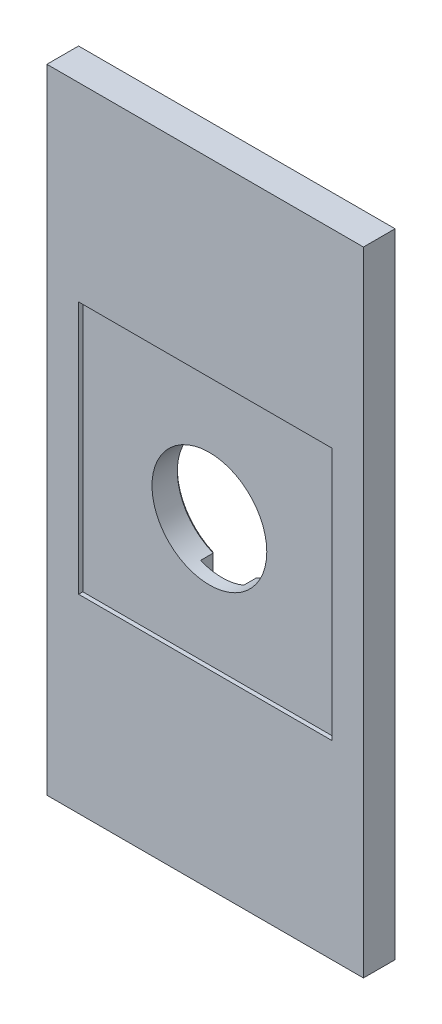
ISO-10303-21;
HEADER;
FILE_DESCRIPTION(('STEP AP214'),'2;1');
FILE_NAME('part.step','',(''),(''),'','','');
FILE_SCHEMA(('AUTOMOTIVE_DESIGN { 1 0 10303 214 1 1 1 1 }'));
ENDSEC;
DATA;
#1=APPLICATION_CONTEXT('core data for automotive mechanical design processes');
#2=APPLICATION_PROTOCOL_DEFINITION('international standard','automotive_design',2000,#1);
#3=PRODUCT_CONTEXT('',#1,'mechanical');
#4=PRODUCT('Part','Part','',(#3));
#5=PRODUCT_RELATED_PRODUCT_CATEGORY('part','',(#4));
#6=PRODUCT_DEFINITION_FORMATION('','',#4);
#7=PRODUCT_DEFINITION_CONTEXT('part definition',#1,'design');
#8=PRODUCT_DEFINITION('design','',#6,#7);
#9=PRODUCT_DEFINITION_SHAPE('','',#8);
#10=(LENGTH_UNIT() NAMED_UNIT(*) SI_UNIT(.MILLI.,.METRE.));
#11=(NAMED_UNIT(*) PLANE_ANGLE_UNIT() SI_UNIT($,.RADIAN.));
#12=(NAMED_UNIT(*) SI_UNIT($,.STERADIAN.) SOLID_ANGLE_UNIT());
#13=UNCERTAINTY_MEASURE_WITH_UNIT(LENGTH_MEASURE(1.E-05),#10,'distance_accuracy_value','');
#14=(GEOMETRIC_REPRESENTATION_CONTEXT(3) GLOBAL_UNCERTAINTY_ASSIGNED_CONTEXT((#13)) GLOBAL_UNIT_ASSIGNED_CONTEXT((#10,
#11,#12)) REPRESENTATION_CONTEXT('',''));
#15=CARTESIAN_POINT('',(0.,0.,0.));
#16=DIRECTION('',(0.,0.,1.));
#17=DIRECTION('',(1.,0.,0.));
#18=AXIS2_PLACEMENT_3D('',#15,#16,#17);
#19=CARTESIAN_POINT('',(0.,0.,-7.5));
#20=DIRECTION('',(0.,0.,1.));
#21=DIRECTION('',(1.,0.,0.));
#22=AXIS2_PLACEMENT_3D('',#19,#20,#21);
#23=PLANE('',#22);
#24=DIRECTION('',(0.,1.,0.));
#25=VECTOR('',#24,1.);
#26=CARTESIAN_POINT('',(5.6,0.,-7.5));
#27=LINE('',#26,#25);
#28=CARTESIAN_POINT('',(5.6,-30.6,-7.5));
#29=VERTEX_POINT('',#28);
#30=CARTESIAN_POINT('',(5.6,-12.9402472928457,-7.5));
#31=VERTEX_POINT('',#30);
#32=EDGE_CURVE('E303',#29,#31,#27,.T.);
#33=ORIENTED_EDGE('',*,*,#32,.T.);
#34=CARTESIAN_POINT('',(0.,0.,-7.5));
#35=DIRECTION('',(0.,0.,1.));
#36=DIRECTION('',(1.,0.,0.));
#37=AXIS2_PLACEMENT_3D('',#34,#35,#36);
#38=CIRCLE('',#37,14.1);
#39=CARTESIAN_POINT('',(5.6,12.9402472928457,-7.5));
#40=VERTEX_POINT('',#39);
#41=EDGE_CURVE('E305',#31,#40,#38,.T.);
#42=ORIENTED_EDGE('',*,*,#41,.T.);
#43=DIRECTION('',(0.,1.,0.));
#44=VECTOR('',#43,1.);
#45=CARTESIAN_POINT('',(5.6,0.,-7.5));
#46=LINE('',#45,#44);
#47=CARTESIAN_POINT('',(5.6,30.6,-7.5));
#48=VERTEX_POINT('',#47);
#49=EDGE_CURVE('E291',#40,#48,#46,.T.);
#50=ORIENTED_EDGE('',*,*,#49,.T.);
#51=DIRECTION('',(-1.,0.,0.));
#52=VECTOR('',#51,1.);
#53=CARTESIAN_POINT('',(0.,30.6,-7.5));
#54=LINE('',#53,#52);
#55=CARTESIAN_POINT('',(-5.60000000000001,30.6,-7.5));
#56=VERTEX_POINT('',#55);
#57=EDGE_CURVE('E293',#48,#56,#54,.T.);
#58=ORIENTED_EDGE('',*,*,#57,.T.);
#59=DIRECTION('',(0.,-1.,0.));
#60=VECTOR('',#59,1.);
#61=CARTESIAN_POINT('',(-5.60000000000001,0.,-7.5));
#62=LINE('',#61,#60);
#63=CARTESIAN_POINT('',(-5.60000000000001,12.9402472928457,-7.5));
#64=VERTEX_POINT('',#63);
#65=EDGE_CURVE('E295',#56,#64,#62,.T.);
#66=ORIENTED_EDGE('',*,*,#65,.T.);
#67=CARTESIAN_POINT('',(0.,0.,-7.5));
#68=DIRECTION('',(0.,0.,1.));
#69=DIRECTION('',(1.,0.,0.));
#70=AXIS2_PLACEMENT_3D('',#67,#68,#69);
#71=CIRCLE('',#70,14.1);
#72=CARTESIAN_POINT('',(-5.6,-12.9402472928457,-7.5));
#73=VERTEX_POINT('',#72);
#74=EDGE_CURVE('E297',#64,#73,#71,.T.);
#75=ORIENTED_EDGE('',*,*,#74,.T.);
#76=DIRECTION('',(0.,-1.,0.));
#77=VECTOR('',#76,1.);
#78=CARTESIAN_POINT('',(-5.6,0.,-7.5));
#79=LINE('',#78,#77);
#80=CARTESIAN_POINT('',(-5.6,-30.6,-7.5));
#81=VERTEX_POINT('',#80);
#82=EDGE_CURVE('E299',#73,#81,#79,.T.);
#83=ORIENTED_EDGE('',*,*,#82,.T.);
#84=DIRECTION('',(1.,0.,0.));
#85=VECTOR('',#84,1.);
#86=CARTESIAN_POINT('',(0.,-30.6,-7.5));
#87=LINE('',#86,#85);
#88=EDGE_CURVE('E301',#81,#29,#87,.T.);
#89=ORIENTED_EDGE('',*,*,#88,.T.);
#90=EDGE_LOOP('',(#33,#42,#50,#58,#66,#75,#83,#89));
#91=FACE_BOUND('',#90,.T.);
#92=DIRECTION('',(-1.,0.,0.));
#93=VECTOR('',#92,1.);
#94=CARTESIAN_POINT('',(-37.5,-75.,-7.50000000000001));
#95=LINE('',#94,#93);
#96=CARTESIAN_POINT('',(37.5,-75.,-7.50000000000001));
#97=VERTEX_POINT('',#96);
#98=CARTESIAN_POINT('',(-37.5,-75.,-7.50000000000001));
#99=VERTEX_POINT('',#98);
#100=EDGE_CURVE('E262',#97,#99,#95,.T.);
#101=ORIENTED_EDGE('',*,*,#100,.T.);
#102=DIRECTION('',(0.,1.,0.));
#103=VECTOR('',#102,1.);
#104=CARTESIAN_POINT('',(-37.5,-75.,-7.50000000000001));
#105=LINE('',#104,#103);
#106=CARTESIAN_POINT('',(-37.5,75.,-7.50000000000001));
#107=VERTEX_POINT('',#106);
#108=EDGE_CURVE('E265',#99,#107,#105,.T.);
#109=ORIENTED_EDGE('',*,*,#108,.T.);
#110=DIRECTION('',(1.,0.,0.));
#111=VECTOR('',#110,1.);
#112=CARTESIAN_POINT('',(-37.5,75.,-7.50000000000001));
#113=LINE('',#112,#111);
#114=CARTESIAN_POINT('',(37.5,75.,-7.50000000000006));
#115=VERTEX_POINT('',#114);
#116=EDGE_CURVE('E263',#107,#115,#113,.T.);
#117=ORIENTED_EDGE('',*,*,#116,.T.);
#118=DIRECTION('',(0.,-1.,0.));
#119=VECTOR('',#118,1.);
#120=CARTESIAN_POINT('',(37.5,-75.,-7.50000000000001));
#121=LINE('',#120,#119);
#122=EDGE_CURVE('E200',#115,#97,#121,.T.);
#123=ORIENTED_EDGE('',*,*,#122,.T.);
#124=EDGE_LOOP('',(#101,#109,#117,#123));
#125=FACE_BOUND('',#124,.T.);
#126=ADVANCED_FACE('F43',(#91,#125),#23,.F.);
#127=CARTESIAN_POINT('',(-30.,30.,-85.8528137423857));
#128=DIRECTION('',(0.,1.,0.));
#129=DIRECTION('',(0.,0.,1.));
#130=AXIS2_PLACEMENT_3D('',#127,#128,#129);
#131=PLANE('',#130);
#132=DIRECTION('',(1.,0.,0.));
#133=VECTOR('',#132,1.);
#134=CARTESIAN_POINT('',(-30.,30.,-1.));
#135=LINE('',#134,#133);
#136=CARTESIAN_POINT('',(-30.,30.,-1.));
#137=VERTEX_POINT('',#136);
#138=CARTESIAN_POINT('',(30.,30.,-1.));
#139=VERTEX_POINT('',#138);
#140=EDGE_CURVE('E233',#137,#139,#135,.T.);
#141=ORIENTED_EDGE('',*,*,#140,.T.);
#142=DIRECTION('',(0.,0.,1.));
#143=VECTOR('',#142,1.);
#144=CARTESIAN_POINT('',(30.,30.,-85.8528137423857));
#145=LINE('',#144,#143);
#146=CARTESIAN_POINT('',(30.,30.,0.));
#147=VERTEX_POINT('',#146);
#148=EDGE_CURVE('E253',#139,#147,#145,.T.);
#149=ORIENTED_EDGE('',*,*,#148,.T.);
#150=DIRECTION('',(-1.,0.,0.));
#151=VECTOR('',#150,1.);
#152=CARTESIAN_POINT('',(-30.,30.,0.));
#153=LINE('',#152,#151);
#154=CARTESIAN_POINT('',(-30.,30.,0.));
#155=VERTEX_POINT('',#154);
#156=EDGE_CURVE('E245',#147,#155,#153,.T.);
#157=ORIENTED_EDGE('',*,*,#156,.T.);
#158=DIRECTION('',(0.,0.,1.));
#159=VECTOR('',#158,1.);
#160=CARTESIAN_POINT('',(-30.,30.,-85.8528137423857));
#161=LINE('',#160,#159);
#162=EDGE_CURVE('E258',#137,#155,#161,.T.);
#163=ORIENTED_EDGE('',*,*,#162,.F.);
#164=EDGE_LOOP('',(#141,#149,#157,#163));
#165=FACE_BOUND('',#164,.T.);
#166=ADVANCED_FACE('F454',(#165),#131,.F.);
#167=CARTESIAN_POINT('',(-30.,-30.,-85.8528137423857));
#168=DIRECTION('',(-1.,0.,0.));
#169=DIRECTION('',(0.,0.,1.));
#170=AXIS2_PLACEMENT_3D('',#167,#168,#169);
#171=PLANE('',#170);
#172=DIRECTION('',(0.,1.,0.));
#173=VECTOR('',#172,1.);
#174=CARTESIAN_POINT('',(-30.,-30.,-1.));
#175=LINE('',#174,#173);
#176=CARTESIAN_POINT('',(-30.,-30.,-1.));
#177=VERTEX_POINT('',#176);
#178=EDGE_CURVE('E237',#177,#137,#175,.T.);
#179=ORIENTED_EDGE('',*,*,#178,.T.);
#180=ORIENTED_EDGE('',*,*,#162,.T.);
#181=DIRECTION('',(0.,-1.,0.));
#182=VECTOR('',#181,1.);
#183=CARTESIAN_POINT('',(-30.,-30.,0.));
#184=LINE('',#183,#182);
#185=CARTESIAN_POINT('',(-30.,-30.,0.));
#186=VERTEX_POINT('',#185);
#187=EDGE_CURVE('E248',#155,#186,#184,.T.);
#188=ORIENTED_EDGE('',*,*,#187,.T.);
#189=DIRECTION('',(0.,0.,1.));
#190=VECTOR('',#189,1.);
#191=CARTESIAN_POINT('',(-30.,-30.,-85.8528137423857));
#192=LINE('',#191,#190);
#193=EDGE_CURVE('E256',#177,#186,#192,.T.);
#194=ORIENTED_EDGE('',*,*,#193,.F.);
#195=EDGE_LOOP('',(#179,#180,#188,#194));
#196=FACE_BOUND('',#195,.T.);
#197=ADVANCED_FACE('F461',(#196),#171,.F.);
#198=CARTESIAN_POINT('',(-30.,-30.,-85.8528137423857));
#199=DIRECTION('',(0.,-1.,0.));
#200=DIRECTION('',(0.,0.,-1.));
#201=AXIS2_PLACEMENT_3D('',#198,#199,#200);
#202=PLANE('',#201);
#203=DIRECTION('',(-1.,0.,0.));
#204=VECTOR('',#203,1.);
#205=CARTESIAN_POINT('',(-30.,-30.,-1.));
#206=LINE('',#205,#204);
#207=CARTESIAN_POINT('',(30.,-30.,-1.));
#208=VERTEX_POINT('',#207);
#209=EDGE_CURVE('E239',#208,#177,#206,.T.);
#210=ORIENTED_EDGE('',*,*,#209,.T.);
#211=ORIENTED_EDGE('',*,*,#193,.T.);
#212=DIRECTION('',(1.,0.,0.));
#213=VECTOR('',#212,1.);
#214=CARTESIAN_POINT('',(-30.,-30.,0.));
#215=LINE('',#214,#213);
#216=CARTESIAN_POINT('',(30.,-30.,0.));
#217=VERTEX_POINT('',#216);
#218=EDGE_CURVE('E251',#186,#217,#215,.T.);
#219=ORIENTED_EDGE('',*,*,#218,.T.);
#220=DIRECTION('',(0.,0.,1.));
#221=VECTOR('',#220,1.);
#222=CARTESIAN_POINT('',(30.,-30.,-85.8528137423857));
#223=LINE('',#222,#221);
#224=EDGE_CURVE('E240',#208,#217,#223,.T.);
#225=ORIENTED_EDGE('',*,*,#224,.F.);
#226=EDGE_LOOP('',(#210,#211,#219,#225));
#227=FACE_BOUND('',#226,.T.);
#228=ADVANCED_FACE('F545',(#227),#202,.F.);
#229=CARTESIAN_POINT('',(30.,-30.,-85.8528137423857));
#230=DIRECTION('',(1.,0.,0.));
#231=DIRECTION('',(0.,0.,-1.));
#232=AXIS2_PLACEMENT_3D('',#229,#230,#231);
#233=PLANE('',#232);
#234=DIRECTION('',(0.,-1.,0.));
#235=VECTOR('',#234,1.);
#236=CARTESIAN_POINT('',(30.,-30.,-1.));
#237=LINE('',#236,#235);
#238=EDGE_CURVE('E236',#139,#208,#237,.T.);
#239=ORIENTED_EDGE('',*,*,#238,.T.);
#240=ORIENTED_EDGE('',*,*,#224,.T.);
#241=DIRECTION('',(0.,1.,0.));
#242=VECTOR('',#241,1.);
#243=CARTESIAN_POINT('',(30.,-30.,0.));
#244=LINE('',#243,#242);
#245=EDGE_CURVE('E229',#217,#147,#244,.T.);
#246=ORIENTED_EDGE('',*,*,#245,.T.);
#247=ORIENTED_EDGE('',*,*,#148,.F.);
#248=EDGE_LOOP('',(#239,#240,#246,#247));
#249=FACE_BOUND('',#248,.T.);
#250=ADVANCED_FACE('F507',(#249),#233,.F.);
#251=CARTESIAN_POINT('',(0.,0.,-1.));
#252=DIRECTION('',(0.,0.,1.));
#253=DIRECTION('',(1.,0.,0.));
#254=AXIS2_PLACEMENT_3D('',#251,#252,#253);
#255=PLANE('',#254);
#256=CARTESIAN_POINT('',(0.,0.,-1.));
#257=DIRECTION('',(0.,0.,1.));
#258=DIRECTION('',(1.,0.,0.));
#259=AXIS2_PLACEMENT_3D('',#256,#257,#258);
#260=CIRCLE('',#259,13.6);
#261=CARTESIAN_POINT('',(13.6,0.,-1.));
#262=VERTEX_POINT('',#261);
#263=EDGE_CURVE('E209',#262,#262,#260,.F.);
#264=ORIENTED_EDGE('',*,*,#263,.T.);
#265=EDGE_LOOP('',(#264));
#266=FACE_BOUND('',#265,.T.);
#267=ORIENTED_EDGE('',*,*,#238,.F.);
#268=ORIENTED_EDGE('',*,*,#140,.F.);
#269=ORIENTED_EDGE('',*,*,#178,.F.);
#270=ORIENTED_EDGE('',*,*,#209,.F.);
#271=EDGE_LOOP('',(#267,#268,#269,#270));
#272=FACE_BOUND('',#271,.T.);
#273=ADVANCED_FACE('F501',(#266,#272),#255,.T.);
#274=CARTESIAN_POINT('',(-37.5,-75.,-175.205098312484));
#275=DIRECTION('',(-1.,0.,0.));
#276=DIRECTION('',(0.,-1.,0.));
#277=AXIS2_PLACEMENT_3D('',#274,#275,#276);
#278=PLANE('',#277);
#279=ORIENTED_EDGE('',*,*,#108,.F.);
#280=DIRECTION('',(0.,0.,1.));
#281=VECTOR('',#280,1.);
#282=CARTESIAN_POINT('',(-37.5,-75.,-175.205098312484));
#283=LINE('',#282,#281);
#284=CARTESIAN_POINT('',(-37.5,-75.,0.));
#285=VERTEX_POINT('',#284);
#286=EDGE_CURVE('E266',#99,#285,#283,.T.);
#287=ORIENTED_EDGE('',*,*,#286,.T.);
#288=DIRECTION('',(0.,-1.,0.));
#289=VECTOR('',#288,1.);
#290=CARTESIAN_POINT('',(-37.5,-75.,0.));
#291=LINE('',#290,#289);
#292=CARTESIAN_POINT('',(-37.5,75.,0.));
#293=VERTEX_POINT('',#292);
#294=EDGE_CURVE('E277',#293,#285,#291,.T.);
#295=ORIENTED_EDGE('',*,*,#294,.F.);
#296=DIRECTION('',(0.,0.,1.));
#297=VECTOR('',#296,1.);
#298=CARTESIAN_POINT('',(-37.5,75.,-175.205098312484));
#299=LINE('',#298,#297);
#300=EDGE_CURVE('E282',#107,#293,#299,.T.);
#301=ORIENTED_EDGE('',*,*,#300,.F.);
#302=EDGE_LOOP('',(#279,#287,#295,#301));
#303=FACE_BOUND('',#302,.T.);
#304=ADVANCED_FACE('F499',(#303),#278,.T.);
#305=CARTESIAN_POINT('',(-37.5,75.,-175.205098312484));
#306=DIRECTION('',(0.,1.,0.));
#307=DIRECTION('',(-1.,0.,0.));
#308=AXIS2_PLACEMENT_3D('',#305,#306,#307);
#309=PLANE('',#308);
#310=ORIENTED_EDGE('',*,*,#116,.F.);
#311=ORIENTED_EDGE('',*,*,#300,.T.);
#312=DIRECTION('',(-1.,0.,0.));
#313=VECTOR('',#312,1.);
#314=CARTESIAN_POINT('',(-37.5,75.,0.));
#315=LINE('',#314,#313);
#316=CARTESIAN_POINT('',(37.5,75.,0.));
#317=VERTEX_POINT('',#316);
#318=EDGE_CURVE('E274',#317,#293,#315,.T.);
#319=ORIENTED_EDGE('',*,*,#318,.F.);
#320=DIRECTION('',(0.,0.,1.));
#321=VECTOR('',#320,1.);
#322=CARTESIAN_POINT('',(37.5,75.,-175.205098312484));
#323=LINE('',#322,#321);
#324=EDGE_CURVE('E284',#115,#317,#323,.T.);
#325=ORIENTED_EDGE('',*,*,#324,.F.);
#326=EDGE_LOOP('',(#310,#311,#319,#325));
#327=FACE_BOUND('',#326,.T.);
#328=ADVANCED_FACE('F495',(#327),#309,.T.);
#329=CARTESIAN_POINT('',(37.5,-75.,-175.205098312484));
#330=DIRECTION('',(1.,0.,0.));
#331=DIRECTION('',(0.,0.,-1.));
#332=AXIS2_PLACEMENT_3D('',#329,#330,#331);
#333=PLANE('',#332);
#334=ORIENTED_EDGE('',*,*,#122,.F.);
#335=ORIENTED_EDGE('',*,*,#324,.T.);
#336=DIRECTION('',(0.,1.,0.));
#337=VECTOR('',#336,1.);
#338=CARTESIAN_POINT('',(37.5,-75.,0.));
#339=LINE('',#338,#337);
#340=CARTESIAN_POINT('',(37.5,-75.,0.));
#341=VERTEX_POINT('',#340);
#342=EDGE_CURVE('E271',#341,#317,#339,.T.);
#343=ORIENTED_EDGE('',*,*,#342,.F.);
#344=DIRECTION('',(0.,0.,1.));
#345=VECTOR('',#344,1.);
#346=CARTESIAN_POINT('',(37.5,-75.,-175.205098312484));
#347=LINE('',#346,#345);
#348=EDGE_CURVE('E280',#97,#341,#347,.T.);
#349=ORIENTED_EDGE('',*,*,#348,.F.);
#350=EDGE_LOOP('',(#334,#335,#343,#349));
#351=FACE_BOUND('',#350,.T.);
#352=ADVANCED_FACE('F477',(#351),#333,.T.);
#353=CARTESIAN_POINT('',(-37.5,-75.,-175.205098312484));
#354=DIRECTION('',(0.,-1.,0.));
#355=DIRECTION('',(1.,0.,0.));
#356=AXIS2_PLACEMENT_3D('',#353,#354,#355);
#357=PLANE('',#356);
#358=ORIENTED_EDGE('',*,*,#100,.F.);
#359=ORIENTED_EDGE('',*,*,#348,.T.);
#360=DIRECTION('',(1.,0.,0.));
#361=VECTOR('',#360,1.);
#362=CARTESIAN_POINT('',(-37.5,-75.,0.));
#363=LINE('',#362,#361);
#364=EDGE_CURVE('E235',#285,#341,#363,.T.);
#365=ORIENTED_EDGE('',*,*,#364,.F.);
#366=ORIENTED_EDGE('',*,*,#286,.F.);
#367=EDGE_LOOP('',(#358,#359,#365,#366));
#368=FACE_BOUND('',#367,.T.);
#369=ADVANCED_FACE('F465',(#368),#357,.T.);
#370=CARTESIAN_POINT('',(0.,0.,0.));
#371=DIRECTION('',(0.,0.,1.));
#372=DIRECTION('',(1.,0.,0.));
#373=AXIS2_PLACEMENT_3D('',#370,#371,#372);
#374=PLANE('',#373);
#375=ORIENTED_EDGE('',*,*,#156,.F.);
#376=ORIENTED_EDGE('',*,*,#245,.F.);
#377=ORIENTED_EDGE('',*,*,#218,.F.);
#378=ORIENTED_EDGE('',*,*,#187,.F.);
#379=EDGE_LOOP('',(#375,#376,#377,#378));
#380=FACE_BOUND('',#379,.T.);
#381=ORIENTED_EDGE('',*,*,#364,.T.);
#382=ORIENTED_EDGE('',*,*,#342,.T.);
#383=ORIENTED_EDGE('',*,*,#318,.T.);
#384=ORIENTED_EDGE('',*,*,#294,.T.);
#385=EDGE_LOOP('',(#381,#382,#383,#384));
#386=FACE_BOUND('',#385,.T.);
#387=ADVANCED_FACE('F467',(#380,#386),#374,.T.);
#388=CARTESIAN_POINT('',(0.,0.,-4.));
#389=DIRECTION('',(0.,0.,1.));
#390=DIRECTION('',(-1.,0.,0.));
#391=AXIS2_PLACEMENT_3D('',#388,#389,#390);
#392=PLANE('',#391);
#393=DIRECTION('',(0.,-1.,0.));
#394=VECTOR('',#393,1.);
#395=CARTESIAN_POINT('',(5.1,-12.6075374280626,-4.));
#396=LINE('',#395,#394);
#397=CARTESIAN_POINT('',(5.1,30.1,-3.99999999999999));
#398=VERTEX_POINT('',#397);
#399=CARTESIAN_POINT('',(5.1,12.6075374280626,-4.));
#400=VERTEX_POINT('',#399);
#401=EDGE_CURVE('E207',#398,#400,#396,.T.);
#402=ORIENTED_EDGE('',*,*,#401,.T.);
#403=CARTESIAN_POINT('',(0.,0.,-4.));
#404=DIRECTION('',(0.,0.,1.));
#405=DIRECTION('',(0.,-1.,0.));
#406=AXIS2_PLACEMENT_3D('',#403,#404,#405);
#407=CIRCLE('',#406,13.6);
#408=CARTESIAN_POINT('',(-5.10000000000001,12.6075374280626,-4.));
#409=VERTEX_POINT('',#408);
#410=EDGE_CURVE('E193',#400,#409,#407,.T.);
#411=ORIENTED_EDGE('',*,*,#410,.T.);
#412=DIRECTION('',(0.,1.,0.));
#413=VECTOR('',#412,1.);
#414=CARTESIAN_POINT('',(-5.10000000000001,12.6075374280626,-4.));
#415=LINE('',#414,#413);
#416=CARTESIAN_POINT('',(-5.10000000000001,30.1,-4.));
#417=VERTEX_POINT('',#416);
#418=EDGE_CURVE('E205',#409,#417,#415,.T.);
#419=ORIENTED_EDGE('',*,*,#418,.T.);
#420=DIRECTION('',(1.,0.,0.));
#421=VECTOR('',#420,1.);
#422=CARTESIAN_POINT('',(-5.10000000000001,30.1,-4.));
#423=LINE('',#422,#421);
#424=EDGE_CURVE('E222',#417,#398,#423,.T.);
#425=ORIENTED_EDGE('',*,*,#424,.T.);
#426=EDGE_LOOP('',(#402,#411,#419,#425));
#427=FACE_BOUND('',#426,.T.);
#428=ADVANCED_FACE('F203',(#427),#392,.F.);
#429=CARTESIAN_POINT('',(-5.1,-30.1,-4.));
#430=VERTEX_POINT('',#429);
#431=CARTESIAN_POINT('',(-5.1,-12.6075374280626,-4.));
#432=VERTEX_POINT('',#431);
#433=EDGE_CURVE('E213',#430,#432,#415,.T.);
#434=ORIENTED_EDGE('',*,*,#433,.T.);
#435=CARTESIAN_POINT('',(0.,0.,-4.));
#436=DIRECTION('',(0.,0.,1.));
#437=DIRECTION('',(0.,-1.,0.));
#438=AXIS2_PLACEMENT_3D('',#435,#436,#437);
#439=CIRCLE('',#438,13.6);
#440=CARTESIAN_POINT('',(5.1,-12.6075374280626,-4.));
#441=VERTEX_POINT('',#440);
#442=EDGE_CURVE('E416',#432,#441,#439,.T.);
#443=ORIENTED_EDGE('',*,*,#442,.T.);
#444=CARTESIAN_POINT('',(5.1,-30.1,-4.));
#445=VERTEX_POINT('',#444);
#446=EDGE_CURVE('E415',#441,#445,#396,.T.);
#447=ORIENTED_EDGE('',*,*,#446,.T.);
#448=DIRECTION('',(-1.,0.,0.));
#449=VECTOR('',#448,1.);
#450=CARTESIAN_POINT('',(5.1,-30.1,-4.));
#451=LINE('',#450,#449);
#452=EDGE_CURVE('E218',#445,#430,#451,.T.);
#453=ORIENTED_EDGE('',*,*,#452,.T.);
#454=EDGE_LOOP('',(#434,#443,#447,#453));
#455=FACE_BOUND('',#454,.T.);
#456=ADVANCED_FACE('F424',(#455),#392,.F.);
#457=CARTESIAN_POINT('',(-5.10000000000001,12.6075374280626,57.0580052081625));
#458=DIRECTION('',(-1.,0.,0.));
#459=DIRECTION('',(0.,-1.,0.));
#460=AXIS2_PLACEMENT_3D('',#457,#458,#459);
#461=PLANE('',#460);
#462=DIRECTION('',(0.,0.,-1.));
#463=VECTOR('',#462,1.);
#464=CARTESIAN_POINT('',(-5.1,-30.1,57.0580052081625));
#465=LINE('',#464,#463);
#466=CARTESIAN_POINT('',(-5.1,-30.1,-7.));
#467=VERTEX_POINT('',#466);
#468=EDGE_CURVE('E214',#430,#467,#465,.T.);
#469=ORIENTED_EDGE('',*,*,#468,.T.);
#470=DIRECTION('',(0.,1.,0.));
#471=VECTOR('',#470,1.);
#472=CARTESIAN_POINT('',(-5.10000000000001,12.6075374280626,-7.));
#473=LINE('',#472,#471);
#474=CARTESIAN_POINT('',(-5.1,-12.6075374280626,-7.));
#475=VERTEX_POINT('',#474);
#476=EDGE_CURVE('E312',#467,#475,#473,.T.);
#477=ORIENTED_EDGE('',*,*,#476,.T.);
#478=DIRECTION('',(0.,0.,-1.));
#479=VECTOR('',#478,1.);
#480=CARTESIAN_POINT('',(-5.1,-12.6075374280626,37.4666088965482));
#481=LINE('',#480,#479);
#482=EDGE_CURVE('E418',#475,#432,#481,.F.);
#483=ORIENTED_EDGE('',*,*,#482,.T.);
#484=ORIENTED_EDGE('',*,*,#433,.F.);
#485=EDGE_LOOP('',(#469,#477,#483,#484));
#486=FACE_BOUND('',#485,.T.);
#487=ADVANCED_FACE('F431',(#486),#461,.F.);
#488=CARTESIAN_POINT('',(5.1,-12.6075374280626,57.0580052081625));
#489=DIRECTION('',(1.,0.,0.));
#490=DIRECTION('',(0.,1.,0.));
#491=AXIS2_PLACEMENT_3D('',#488,#489,#490);
#492=PLANE('',#491);
#493=DIRECTION('',(0.,0.,-1.));
#494=VECTOR('',#493,1.);
#495=CARTESIAN_POINT('',(5.1,-12.6075374280626,37.4666088965482));
#496=LINE('',#495,#494);
#497=CARTESIAN_POINT('',(5.1,-12.6075374280626,-7.));
#498=VERTEX_POINT('',#497);
#499=EDGE_CURVE('E411',#441,#498,#496,.T.);
#500=ORIENTED_EDGE('',*,*,#499,.T.);
#501=DIRECTION('',(0.,-1.,0.));
#502=VECTOR('',#501,1.);
#503=CARTESIAN_POINT('',(5.1,-12.6075374280626,-7.));
#504=LINE('',#503,#502);
#505=CARTESIAN_POINT('',(5.1,-30.1,-7.));
#506=VERTEX_POINT('',#505);
#507=EDGE_CURVE('E308',#498,#506,#504,.T.);
#508=ORIENTED_EDGE('',*,*,#507,.T.);
#509=DIRECTION('',(0.,0.,-1.));
#510=VECTOR('',#509,1.);
#511=CARTESIAN_POINT('',(5.1,-30.1,57.0580052081625));
#512=LINE('',#511,#510);
#513=EDGE_CURVE('E226',#445,#506,#512,.T.);
#514=ORIENTED_EDGE('',*,*,#513,.F.);
#515=ORIENTED_EDGE('',*,*,#446,.F.);
#516=EDGE_LOOP('',(#500,#508,#514,#515));
#517=FACE_BOUND('',#516,.T.);
#518=ADVANCED_FACE('F414',(#517),#492,.F.);
#519=CARTESIAN_POINT('',(5.1,-30.1,57.0580052081625));
#520=DIRECTION('',(0.,-1.,0.));
#521=DIRECTION('',(1.,0.,0.));
#522=AXIS2_PLACEMENT_3D('',#519,#520,#521);
#523=PLANE('',#522);
#524=ORIENTED_EDGE('',*,*,#513,.T.);
#525=DIRECTION('',(-1.,0.,0.));
#526=VECTOR('',#525,1.);
#527=CARTESIAN_POINT('',(5.1,-30.1,-7.));
#528=LINE('',#527,#526);
#529=EDGE_CURVE('E310',#506,#467,#528,.T.);
#530=ORIENTED_EDGE('',*,*,#529,.T.);
#531=ORIENTED_EDGE('',*,*,#468,.F.);
#532=ORIENTED_EDGE('',*,*,#452,.F.);
#533=EDGE_LOOP('',(#524,#530,#531,#532));
#534=FACE_BOUND('',#533,.T.);
#535=ADVANCED_FACE('F427',(#534),#523,.F.);
#536=DIRECTION('',(0.,0.,-1.));
#537=VECTOR('',#536,1.);
#538=CARTESIAN_POINT('',(5.1,30.1,57.0580052081625));
#539=LINE('',#538,#537);
#540=CARTESIAN_POINT('',(5.1,30.1,-7.));
#541=VERTEX_POINT('',#540);
#542=EDGE_CURVE('E227',#398,#541,#539,.T.);
#543=ORIENTED_EDGE('',*,*,#542,.T.);
#544=DIRECTION('',(0.,-1.,0.));
#545=VECTOR('',#544,1.);
#546=CARTESIAN_POINT('',(5.1,-12.6075374280626,-7.));
#547=LINE('',#546,#545);
#548=CARTESIAN_POINT('',(5.1,12.6075374280626,-7.));
#549=VERTEX_POINT('',#548);
#550=EDGE_CURVE('E11',#541,#549,#547,.T.);
#551=ORIENTED_EDGE('',*,*,#550,.T.);
#552=DIRECTION('',(0.,0.,-1.));
#553=VECTOR('',#552,1.);
#554=CARTESIAN_POINT('',(5.1,12.6075374280626,37.4666088965482));
#555=LINE('',#554,#553);
#556=EDGE_CURVE('E208',#549,#400,#555,.F.);
#557=ORIENTED_EDGE('',*,*,#556,.T.);
#558=ORIENTED_EDGE('',*,*,#401,.F.);
#559=EDGE_LOOP('',(#543,#551,#557,#558));
#560=FACE_BOUND('',#559,.T.);
#561=ADVANCED_FACE('F442',(#560),#492,.F.);
#562=DIRECTION('',(0.,0.,-1.));
#563=VECTOR('',#562,1.);
#564=CARTESIAN_POINT('',(-5.10000000000001,12.6075374280626,37.4666088965482));
#565=LINE('',#564,#563);
#566=CARTESIAN_POINT('',(-5.10000000000001,12.6075374280626,-7.));
#567=VERTEX_POINT('',#566);
#568=EDGE_CURVE('E189',#409,#567,#565,.T.);
#569=ORIENTED_EDGE('',*,*,#568,.T.);
#570=DIRECTION('',(0.,1.,0.));
#571=VECTOR('',#570,1.);
#572=CARTESIAN_POINT('',(-5.10000000000001,12.6075374280626,-7.));
#573=LINE('',#572,#571);
#574=CARTESIAN_POINT('',(-5.10000000000001,30.1,-7.));
#575=VERTEX_POINT('',#574);
#576=EDGE_CURVE('E74',#567,#575,#573,.T.);
#577=ORIENTED_EDGE('',*,*,#576,.T.);
#578=DIRECTION('',(0.,0.,-1.));
#579=VECTOR('',#578,1.);
#580=CARTESIAN_POINT('',(-5.10000000000001,30.1,57.0580052081625));
#581=LINE('',#580,#579);
#582=EDGE_CURVE('E212',#417,#575,#581,.T.);
#583=ORIENTED_EDGE('',*,*,#582,.F.);
#584=ORIENTED_EDGE('',*,*,#418,.F.);
#585=EDGE_LOOP('',(#569,#577,#583,#584));
#586=FACE_BOUND('',#585,.T.);
#587=ADVANCED_FACE('F211',(#586),#461,.F.);
#588=CARTESIAN_POINT('',(-5.10000000000001,30.1,57.0580052081625));
#589=DIRECTION('',(0.,1.,0.));
#590=DIRECTION('',(-1.,0.,0.));
#591=AXIS2_PLACEMENT_3D('',#588,#589,#590);
#592=PLANE('',#591);
#593=ORIENTED_EDGE('',*,*,#582,.T.);
#594=DIRECTION('',(1.,0.,0.));
#595=VECTOR('',#594,1.);
#596=CARTESIAN_POINT('',(-5.10000000000001,30.1,-7.));
#597=LINE('',#596,#595);
#598=EDGE_CURVE('E59',#575,#541,#597,.T.);
#599=ORIENTED_EDGE('',*,*,#598,.T.);
#600=ORIENTED_EDGE('',*,*,#542,.F.);
#601=ORIENTED_EDGE('',*,*,#424,.F.);
#602=EDGE_LOOP('',(#593,#599,#600,#601));
#603=FACE_BOUND('',#602,.T.);
#604=ADVANCED_FACE('F443',(#603),#592,.F.);
#605=CARTESIAN_POINT('',(0.,0.,37.4666088965482));
#606=DIRECTION('',(0.,0.,-1.));
#607=DIRECTION('',(-1.,0.,0.));
#608=AXIS2_PLACEMENT_3D('',#605,#606,#607);
#609=CYLINDRICAL_SURFACE('',#608,13.6);
#610=ORIENTED_EDGE('',*,*,#263,.F.);
#611=EDGE_LOOP('',(#610));
#612=FACE_BOUND('',#611,.T.);
#613=ORIENTED_EDGE('',*,*,#556,.F.);
#614=CARTESIAN_POINT('',(0.,0.,-7.));
#615=DIRECTION('',(0.,0.,1.));
#616=DIRECTION('',(1.,0.,0.));
#617=AXIS2_PLACEMENT_3D('',#614,#615,#616);
#618=CIRCLE('',#617,13.6);
#619=EDGE_CURVE('E288',#549,#498,#618,.F.);
#620=ORIENTED_EDGE('',*,*,#619,.T.);
#621=ORIENTED_EDGE('',*,*,#499,.F.);
#622=ORIENTED_EDGE('',*,*,#442,.F.);
#623=ORIENTED_EDGE('',*,*,#482,.F.);
#624=CARTESIAN_POINT('',(0.,0.,-7.));
#625=DIRECTION('',(0.,0.,1.));
#626=DIRECTION('',(1.,0.,0.));
#627=AXIS2_PLACEMENT_3D('',#624,#625,#626);
#628=CIRCLE('',#627,13.6);
#629=EDGE_CURVE('E197',#475,#567,#628,.F.);
#630=ORIENTED_EDGE('',*,*,#629,.T.);
#631=ORIENTED_EDGE('',*,*,#568,.F.);
#632=ORIENTED_EDGE('',*,*,#410,.F.);
#633=EDGE_LOOP('',(#613,#620,#621,#622,#623,#630,#631,#632));
#634=FACE_BOUND('',#633,.T.);
#635=ADVANCED_FACE('F192',(#612,#634),#609,.F.);
#636=CARTESIAN_POINT('',(0.,0.,-7.));
#637=DIRECTION('',(0.,0.,-1.));
#638=DIRECTION('',(-1.,0.,0.));
#639=AXIS2_PLACEMENT_3D('',#636,#637,#638);
#640=CONICAL_SURFACE('',#639,13.6,0.785398163397448);
#641=CARTESIAN_POINT('',(-5.1,-12.6075374280626,-7.));
#642=CARTESIAN_POINT('',(-5.18313663332641,-12.6635803127568,-7.0831366333264));
#643=CARTESIAN_POINT('',(-5.26637162140013,-12.7193275802848,-7.16637162140013));
#644=CARTESIAN_POINT('',(-5.43303828811149,-12.8302308684115,-7.33303828811148));
#645=CARTESIAN_POINT('',(-5.51646996670443,-12.8853868891445,-7.41646996670442));
#646=CARTESIAN_POINT('',(-5.6,-12.9402472928457,-7.5));
#647=B_SPLINE_CURVE_WITH_KNOTS('',3,(#641,#642,#643,#644,#645,#646),.UNSPECIFIED.,.F.,.F.,(4,2,
4),(0.,0.390736431427806,0.781472774092476),.UNSPECIFIED.);
#648=EDGE_CURVE('E375',#73,#475,#647,.F.);
#649=ORIENTED_EDGE('',*,*,#648,.F.);
#650=ORIENTED_EDGE('',*,*,#74,.F.);
#651=CARTESIAN_POINT('',(-5.10000000000001,12.6075374280626,-7.));
#652=CARTESIAN_POINT('',(-5.18313663332641,12.6635803127568,-7.0831366333264));
#653=CARTESIAN_POINT('',(-5.26637162140014,12.7193275802848,-7.16637162140013));
#654=CARTESIAN_POINT('',(-5.43303828811149,12.8302308684115,-7.33303828811148));
#655=CARTESIAN_POINT('',(-5.51646996670443,12.8853868891445,-7.41646996670442));
#656=CARTESIAN_POINT('',(-5.60000000000001,12.9402472928457,-7.5));
#657=B_SPLINE_CURVE_WITH_KNOTS('',3,(#651,#652,#653,#654,#655,#656),.UNSPECIFIED.,.F.,.F.,(4,2,
4),(0.,0.390736431427807,0.781472774092477),.UNSPECIFIED.);
#658=EDGE_CURVE('E49',#567,#64,#657,.T.);
#659=ORIENTED_EDGE('',*,*,#658,.F.);
#660=ORIENTED_EDGE('',*,*,#629,.F.);
#661=EDGE_LOOP('',(#649,#650,#659,#660));
#662=FACE_BOUND('',#661,.T.);
#663=ADVANCED_FACE('F366',(#662),#640,.F.);
#664=CARTESIAN_POINT('',(-5.10000000000001,12.6075374280626,-7.));
#665=DIRECTION('',(-0.707106781186547,0.,0.707106781186548));
#666=DIRECTION('',(0.,1.,0.));
#667=AXIS2_PLACEMENT_3D('',#664,#665,#666);
#668=PLANE('',#667);
#669=ORIENTED_EDGE('',*,*,#658,.T.);
#670=ORIENTED_EDGE('',*,*,#65,.F.);
#671=DIRECTION('',(-0.577350269189626,0.577350269189627,-0.577350269189625));
#672=VECTOR('',#671,1.);
#673=CARTESIAN_POINT('',(0.730820857312454,24.2691791426875,-1.16917914268754));
#674=LINE('',#673,#672);
#675=EDGE_CURVE('E382',#575,#56,#674,.T.);
#676=ORIENTED_EDGE('',*,*,#675,.F.);
#677=ORIENTED_EDGE('',*,*,#576,.F.);
#678=EDGE_LOOP('',(#669,#670,#676,#677));
#679=FACE_BOUND('',#678,.T.);
#680=ADVANCED_FACE('F46',(#679),#668,.F.);
#681=CARTESIAN_POINT('',(-5.10000000000001,12.6075374280626,-7.));
#682=DIRECTION('',(-0.707106781186547,0.,0.707106781186548));
#683=DIRECTION('',(0.,1.,0.));
#684=AXIS2_PLACEMENT_3D('',#681,#682,#683);
#685=PLANE('',#684);
#686=ORIENTED_EDGE('',*,*,#648,.T.);
#687=ORIENTED_EDGE('',*,*,#476,.F.);
#688=DIRECTION('',(-0.577350269189626,-0.577350269189626,-0.577350269189626));
#689=VECTOR('',#688,1.);
#690=CARTESIAN_POINT('',(-1.69999999999999,-26.7,-3.6));
#691=LINE('',#690,#689);
#692=EDGE_CURVE('E385',#81,#467,#691,.F.);
#693=ORIENTED_EDGE('',*,*,#692,.F.);
#694=ORIENTED_EDGE('',*,*,#82,.F.);
#695=EDGE_LOOP('',(#686,#687,#693,#694));
#696=FACE_BOUND('',#695,.T.);
#697=ADVANCED_FACE('F364',(#696),#685,.F.);
#698=CARTESIAN_POINT('',(-5.10000000000001,30.1,-7.));
#699=DIRECTION('',(0.,0.707106781186546,0.707106781186549));
#700=DIRECTION('',(1.,0.,0.));
#701=AXIS2_PLACEMENT_3D('',#698,#699,#700);
#702=PLANE('',#701);
#703=ORIENTED_EDGE('',*,*,#675,.T.);
#704=ORIENTED_EDGE('',*,*,#57,.F.);
#705=DIRECTION('',(0.577350269189625,0.577350269189627,-0.577350269189625));
#706=VECTOR('',#705,1.);
#707=CARTESIAN_POINT('',(1.7,26.7,-3.6));
#708=LINE('',#707,#706);
#709=EDGE_CURVE('E388',#541,#48,#708,.T.);
#710=ORIENTED_EDGE('',*,*,#709,.F.);
#711=ORIENTED_EDGE('',*,*,#598,.F.);
#712=EDGE_LOOP('',(#703,#704,#710,#711));
#713=FACE_BOUND('',#712,.T.);
#714=ADVANCED_FACE('F358',(#713),#702,.F.);
#715=CARTESIAN_POINT('',(5.1,-30.1,-7.));
#716=DIRECTION('',(0.,-0.707106781186547,0.707106781186547));
#717=DIRECTION('',(-1.,0.,0.));
#718=AXIS2_PLACEMENT_3D('',#715,#716,#717);
#719=PLANE('',#718);
#720=ORIENTED_EDGE('',*,*,#692,.T.);
#721=ORIENTED_EDGE('',*,*,#529,.F.);
#722=DIRECTION('',(0.577350269189626,-0.577350269189625,-0.577350269189626));
#723=VECTOR('',#722,1.);
#724=CARTESIAN_POINT('',(-0.730820857312464,-24.2691791426876,-1.16917914268754));
#725=LINE('',#724,#723);
#726=EDGE_CURVE('E390',#29,#506,#725,.F.);
#727=ORIENTED_EDGE('',*,*,#726,.F.);
#728=ORIENTED_EDGE('',*,*,#88,.F.);
#729=EDGE_LOOP('',(#720,#721,#727,#728));
#730=FACE_BOUND('',#729,.T.);
#731=ADVANCED_FACE('F351',(#730),#719,.F.);
#732=CARTESIAN_POINT('',(5.1,-12.6075374280626,-7.));
#733=DIRECTION('',(0.707106781186547,0.,0.707106781186548));
#734=DIRECTION('',(0.,-1.,0.));
#735=AXIS2_PLACEMENT_3D('',#732,#733,#734);
#736=PLANE('',#735);
#737=ORIENTED_EDGE('',*,*,#709,.T.);
#738=ORIENTED_EDGE('',*,*,#49,.F.);
#739=CARTESIAN_POINT('',(5.6,12.9402472928457,-7.5));
#740=CARTESIAN_POINT('',(5.51646996670443,12.8853868891445,-7.41646996670442));
#741=CARTESIAN_POINT('',(5.43303828811148,12.8302308684115,-7.33303828811148));
#742=CARTESIAN_POINT('',(5.26637162140013,12.7193275802848,-7.16637162140013));
#743=CARTESIAN_POINT('',(5.1831366333264,12.6635803127568,-7.0831366333264));
#744=CARTESIAN_POINT('',(5.1,12.6075374280626,-7.));
#745=B_SPLINE_CURVE_WITH_KNOTS('',3,(#739,#740,#741,#742,#743,#744),.UNSPECIFIED.,.F.,.F.,(4,2,
4),(0.,0.39073634266467,0.781472774092476),.UNSPECIFIED.);
#746=EDGE_CURVE('E324',#549,#40,#745,.F.);
#747=ORIENTED_EDGE('',*,*,#746,.F.);
#748=ORIENTED_EDGE('',*,*,#550,.F.);
#749=EDGE_LOOP('',(#737,#738,#747,#748));
#750=FACE_BOUND('',#749,.T.);
#751=ADVANCED_FACE('F343',(#750),#736,.F.);
#752=CARTESIAN_POINT('',(5.1,-12.6075374280626,-7.));
#753=DIRECTION('',(0.707106781186547,0.,0.707106781186548));
#754=DIRECTION('',(0.,-1.,0.));
#755=AXIS2_PLACEMENT_3D('',#752,#753,#754);
#756=PLANE('',#755);
#757=ORIENTED_EDGE('',*,*,#726,.T.);
#758=ORIENTED_EDGE('',*,*,#507,.F.);
#759=CARTESIAN_POINT('',(5.1,-12.6075374280626,-7.));
#760=CARTESIAN_POINT('',(5.18313663332641,-12.6635803127568,-7.0831366333264));
#761=CARTESIAN_POINT('',(5.26637162140013,-12.7193275802848,-7.16637162140013));
#762=CARTESIAN_POINT('',(5.43303828811149,-12.8302308684115,-7.33303828811148));
#763=CARTESIAN_POINT('',(5.51646996670443,-12.8853868891445,-7.41646996670442));
#764=CARTESIAN_POINT('',(5.6,-12.9402472928457,-7.5));
#765=B_SPLINE_CURVE_WITH_KNOTS('',3,(#759,#760,#761,#762,#763,#764),.UNSPECIFIED.,.F.,.F.,(4,2,
4),(0.,0.390736431427806,0.781472774092476),.UNSPECIFIED.);
#766=EDGE_CURVE('E316',#31,#498,#765,.F.);
#767=ORIENTED_EDGE('',*,*,#766,.F.);
#768=ORIENTED_EDGE('',*,*,#32,.F.);
#769=EDGE_LOOP('',(#757,#758,#767,#768));
#770=FACE_BOUND('',#769,.T.);
#771=ADVANCED_FACE('F332',(#770),#756,.F.);
#772=CARTESIAN_POINT('',(0.,0.,-7.));
#773=DIRECTION('',(0.,0.,-1.));
#774=DIRECTION('',(-1.,0.,0.));
#775=AXIS2_PLACEMENT_3D('',#772,#773,#774);
#776=CONICAL_SURFACE('',#775,13.6,0.785398163397448);
#777=ORIENTED_EDGE('',*,*,#746,.T.);
#778=ORIENTED_EDGE('',*,*,#41,.F.);
#779=ORIENTED_EDGE('',*,*,#766,.T.);
#780=ORIENTED_EDGE('',*,*,#619,.F.);
#781=EDGE_LOOP('',(#777,#778,#779,#780));
#782=FACE_BOUND('',#781,.T.);
#783=ADVANCED_FACE('F336',(#782),#776,.F.);
#784=CLOSED_SHELL('',(#126,#166,#197,#228,#250,#273,#304,#328,#352,#369,#387,#428,#456,#487,
#518,#535,#561,#587,#604,#635,#663,#680,#697,#714,#731,#751,#771,#783));
#785=MANIFOLD_SOLID_BREP('B2',#784);
#786=ADVANCED_BREP_SHAPE_REPRESENTATION('',(#18,#785),#14);
#787=SHAPE_DEFINITION_REPRESENTATION(#9,#786);
ENDSEC;
END-ISO-10303-21;
